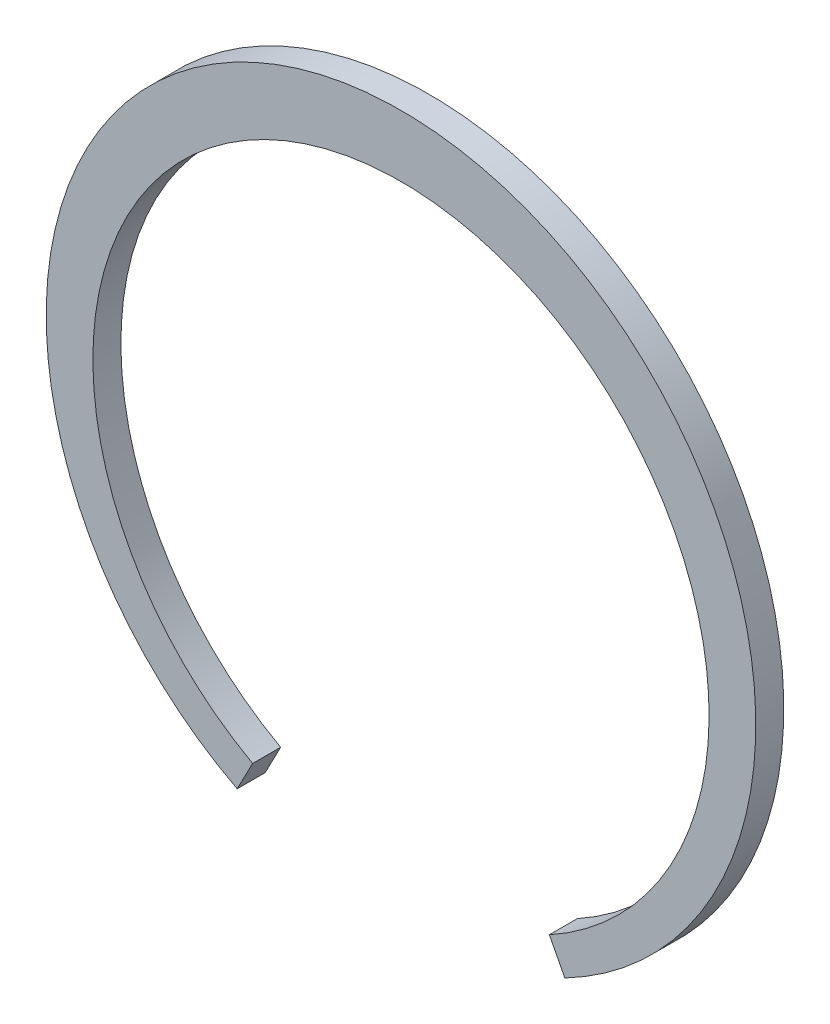
ISO-10303-21;
HEADER;
FILE_DESCRIPTION(('STEP AP214'),'2;1');
FILE_NAME('part.step','',(''),(''),'','','');
FILE_SCHEMA(('AUTOMOTIVE_DESIGN { 1 0 10303 214 1 1 1 1 }'));
ENDSEC;
DATA;
#1=APPLICATION_CONTEXT('core data for automotive mechanical design processes');
#2=APPLICATION_PROTOCOL_DEFINITION('international standard','automotive_design',2000,#1);
#3=PRODUCT_CONTEXT('',#1,'mechanical');
#4=PRODUCT('Part','Part','',(#3));
#5=PRODUCT_RELATED_PRODUCT_CATEGORY('part','',(#4));
#6=PRODUCT_DEFINITION_FORMATION('','',#4);
#7=PRODUCT_DEFINITION_CONTEXT('part definition',#1,'design');
#8=PRODUCT_DEFINITION('design','',#6,#7);
#9=PRODUCT_DEFINITION_SHAPE('','',#8);
#10=(LENGTH_UNIT() NAMED_UNIT(*) SI_UNIT(.MILLI.,.METRE.));
#11=(NAMED_UNIT(*) PLANE_ANGLE_UNIT() SI_UNIT($,.RADIAN.));
#12=(NAMED_UNIT(*) SI_UNIT($,.STERADIAN.) SOLID_ANGLE_UNIT());
#13=UNCERTAINTY_MEASURE_WITH_UNIT(LENGTH_MEASURE(1.E-05),#10,'distance_accuracy_value','');
#14=(GEOMETRIC_REPRESENTATION_CONTEXT(3) GLOBAL_UNCERTAINTY_ASSIGNED_CONTEXT((#13)) GLOBAL_UNIT_ASSIGNED_CONTEXT((#10,
#11,#12)) REPRESENTATION_CONTEXT('',''));
#15=CARTESIAN_POINT('',(0.,0.,0.));
#16=DIRECTION('',(0.,0.,1.));
#17=DIRECTION('',(1.,0.,0.));
#18=AXIS2_PLACEMENT_3D('',#15,#16,#17);
#19=CARTESIAN_POINT('',(0.,-0.8,1.5));
#20=DIRECTION('',(0.,0.,-1.));
#21=DIRECTION('',(-1.,0.,0.));
#22=AXIS2_PLACEMENT_3D('',#19,#20,#21);
#23=CYLINDRICAL_SURFACE('',#22,16.5);
#24=CARTESIAN_POINT('',(0.,-0.8,0.));
#25=DIRECTION('',(0.,0.,-1.));
#26=DIRECTION('',(1.,0.,0.));
#27=AXIS2_PLACEMENT_3D('',#24,#25,#26);
#28=CIRCLE('',#27,16.5);
#29=CARTESIAN_POINT('',(-7.94460335871015,-15.2614410579572,0.));
#30=VERTEX_POINT('',#29);
#31=CARTESIAN_POINT('',(7.94460335871015,-15.2614410579572,0.));
#32=VERTEX_POINT('',#31);
#33=EDGE_CURVE('E96',#30,#32,#28,.T.);
#34=ORIENTED_EDGE('',*,*,#33,.T.);
#35=DIRECTION('',(0.,0.,-1.));
#36=VECTOR('',#35,1.);
#37=CARTESIAN_POINT('',(7.94460335871015,-15.2614410579572,1.5));
#38=LINE('',#37,#36);
#39=CARTESIAN_POINT('',(7.94460335871015,-15.2614410579572,1.5));
#40=VERTEX_POINT('',#39);
#41=EDGE_CURVE('E11',#40,#32,#38,.T.);
#42=ORIENTED_EDGE('',*,*,#41,.F.);
#43=CARTESIAN_POINT('',(0.,-0.8,1.5));
#44=DIRECTION('',(0.,0.,-1.));
#45=DIRECTION('',(1.,0.,0.));
#46=AXIS2_PLACEMENT_3D('',#43,#44,#45);
#47=CIRCLE('',#46,16.5);
#48=CARTESIAN_POINT('',(-7.94460335871015,-15.2614410579572,1.5));
#49=VERTEX_POINT('',#48);
#50=EDGE_CURVE('E84',#49,#40,#47,.T.);
#51=ORIENTED_EDGE('',*,*,#50,.F.);
#52=DIRECTION('',(0.,0.,-1.));
#53=VECTOR('',#52,1.);
#54=CARTESIAN_POINT('',(-7.94460335871015,-15.2614410579572,1.5));
#55=LINE('',#54,#53);
#56=EDGE_CURVE('E92',#49,#30,#55,.T.);
#57=ORIENTED_EDGE('',*,*,#56,.T.);
#58=EDGE_LOOP('',(#34,#42,#51,#57));
#59=FACE_BOUND('',#58,.T.);
#60=ADVANCED_FACE('F33',(#59),#23,.F.);
#61=CARTESIAN_POINT('',(7.94460335871015,-15.2614410579572,1.5));
#62=DIRECTION('',(0.887010833178221,0.461748613235035,0.));
#63=DIRECTION('',(-0.461748613235035,0.887010833178221,0.));
#64=AXIS2_PLACEMENT_3D('',#61,#62,#63);
#65=PLANE('',#64);
#66=DIRECTION('',(0.461748613235035,-0.887010833178221,0.));
#67=VECTOR('',#66,1.);
#68=CARTESIAN_POINT('',(7.94460335871015,-15.2614410579572,0.));
#69=LINE('',#68,#67);
#70=CARTESIAN_POINT('',(8.77322365146567,-16.8532058303862,0.));
#71=VERTEX_POINT('',#70);
#72=EDGE_CURVE('E88',#32,#71,#69,.T.);
#73=ORIENTED_EDGE('',*,*,#72,.T.);
#74=DIRECTION('',(0.,0.,-1.));
#75=VECTOR('',#74,1.);
#76=CARTESIAN_POINT('',(8.77322365146567,-16.8532058303862,1.5));
#77=LINE('',#76,#75);
#78=CARTESIAN_POINT('',(8.77322365146567,-16.8532058303862,1.5));
#79=VERTEX_POINT('',#78);
#80=EDGE_CURVE('E41',#79,#71,#77,.T.);
#81=ORIENTED_EDGE('',*,*,#80,.F.);
#82=DIRECTION('',(0.461748613235035,-0.887010833178221,0.));
#83=VECTOR('',#82,1.);
#84=CARTESIAN_POINT('',(7.94460335871015,-15.2614410579572,1.5));
#85=LINE('',#84,#83);
#86=EDGE_CURVE('E79',#40,#79,#85,.T.);
#87=ORIENTED_EDGE('',*,*,#86,.F.);
#88=ORIENTED_EDGE('',*,*,#41,.T.);
#89=EDGE_LOOP('',(#73,#81,#87,#88));
#90=FACE_BOUND('',#89,.T.);
#91=ADVANCED_FACE('F87',(#90),#65,.F.);
#92=CARTESIAN_POINT('',(0.,0.,1.5));
#93=DIRECTION('',(0.,0.,-1.));
#94=DIRECTION('',(-1.,0.,0.));
#95=AXIS2_PLACEMENT_3D('',#92,#93,#94);
#96=CYLINDRICAL_SURFACE('',#95,19.);
#97=CARTESIAN_POINT('',(0.,0.,0.));
#98=DIRECTION('',(0.,0.,1.));
#99=DIRECTION('',(1.,0.,0.));
#100=AXIS2_PLACEMENT_3D('',#97,#98,#99);
#101=CIRCLE('',#100,19.);
#102=CARTESIAN_POINT('',(-8.77322365146568,-16.8532058303862,0.));
#103=VERTEX_POINT('',#102);
#104=EDGE_CURVE('E66',#71,#103,#101,.T.);
#105=ORIENTED_EDGE('',*,*,#104,.T.);
#106=DIRECTION('',(0.,0.,-1.));
#107=VECTOR('',#106,1.);
#108=CARTESIAN_POINT('',(-8.77322365146568,-16.8532058303862,1.5));
#109=LINE('',#108,#107);
#110=CARTESIAN_POINT('',(-8.77322365146568,-16.8532058303862,1.5));
#111=VERTEX_POINT('',#110);
#112=EDGE_CURVE('E89',#111,#103,#109,.T.);
#113=ORIENTED_EDGE('',*,*,#112,.F.);
#114=CARTESIAN_POINT('',(0.,0.,1.5));
#115=DIRECTION('',(0.,0.,1.));
#116=DIRECTION('',(1.,0.,0.));
#117=AXIS2_PLACEMENT_3D('',#114,#115,#116);
#118=CIRCLE('',#117,19.);
#119=EDGE_CURVE('E82',#79,#111,#118,.T.);
#120=ORIENTED_EDGE('',*,*,#119,.F.);
#121=ORIENTED_EDGE('',*,*,#80,.T.);
#122=EDGE_LOOP('',(#105,#113,#120,#121));
#123=FACE_BOUND('',#122,.T.);
#124=ADVANCED_FACE('F90',(#123),#96,.T.);
#125=CARTESIAN_POINT('',(-7.94460335871015,-15.2614410579572,1.5));
#126=DIRECTION('',(-0.887010833178221,0.461748613235034,0.));
#127=DIRECTION('',(-0.461748613235034,-0.887010833178222,0.));
#128=AXIS2_PLACEMENT_3D('',#125,#126,#127);
#129=PLANE('',#128);
#130=DIRECTION('',(0.461748613235034,0.887010833178221,0.));
#131=VECTOR('',#130,1.);
#132=CARTESIAN_POINT('',(-7.94460335871015,-15.2614410579572,0.));
#133=LINE('',#132,#131);
#134=EDGE_CURVE('E72',#103,#30,#133,.T.);
#135=ORIENTED_EDGE('',*,*,#134,.T.);
#136=ORIENTED_EDGE('',*,*,#56,.F.);
#137=DIRECTION('',(0.461748613235034,0.887010833178221,0.));
#138=VECTOR('',#137,1.);
#139=CARTESIAN_POINT('',(-7.94460335871015,-15.2614410579572,1.5));
#140=LINE('',#139,#138);
#141=EDGE_CURVE('E49',#111,#49,#140,.T.);
#142=ORIENTED_EDGE('',*,*,#141,.F.);
#143=ORIENTED_EDGE('',*,*,#112,.T.);
#144=EDGE_LOOP('',(#135,#136,#142,#143));
#145=FACE_BOUND('',#144,.T.);
#146=ADVANCED_FACE('F103',(#145),#129,.F.);
#147=CARTESIAN_POINT('',(0.,-0.8,1.5));
#148=DIRECTION('',(0.,0.,1.));
#149=DIRECTION('',(1.,0.,0.));
#150=AXIS2_PLACEMENT_3D('',#147,#148,#149);
#151=PLANE('',#150);
#152=ORIENTED_EDGE('',*,*,#50,.T.);
#153=ORIENTED_EDGE('',*,*,#86,.T.);
#154=ORIENTED_EDGE('',*,*,#119,.T.);
#155=ORIENTED_EDGE('',*,*,#141,.T.);
#156=EDGE_LOOP('',(#152,#153,#154,#155));
#157=FACE_BOUND('',#156,.T.);
#158=ADVANCED_FACE('F80',(#157),#151,.T.);
#159=CARTESIAN_POINT('',(0.,-0.8,0.));
#160=DIRECTION('',(0.,0.,1.));
#161=DIRECTION('',(1.,0.,0.));
#162=AXIS2_PLACEMENT_3D('',#159,#160,#161);
#163=PLANE('',#162);
#164=ORIENTED_EDGE('',*,*,#33,.F.);
#165=ORIENTED_EDGE('',*,*,#134,.F.);
#166=ORIENTED_EDGE('',*,*,#104,.F.);
#167=ORIENTED_EDGE('',*,*,#72,.F.);
#168=EDGE_LOOP('',(#164,#165,#166,#167));
#169=FACE_BOUND('',#168,.T.);
#170=ADVANCED_FACE('F106',(#169),#163,.F.);
#171=CLOSED_SHELL('',(#60,#91,#124,#146,#158,#170));
#172=MANIFOLD_SOLID_BREP('B2',#171);
#173=ADVANCED_BREP_SHAPE_REPRESENTATION('',(#18,#172),#14);
#174=SHAPE_DEFINITION_REPRESENTATION(#9,#173);
ENDSEC;
END-ISO-10303-21;
